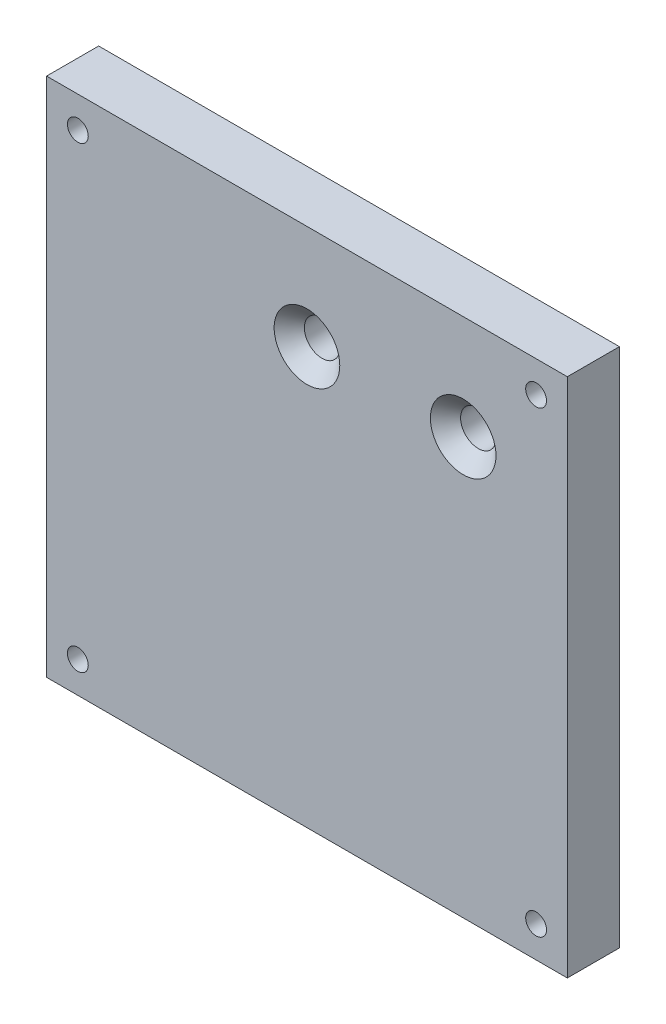
ISO-10303-21;
HEADER;
FILE_DESCRIPTION(('STEP AP214'),'2;1');
FILE_NAME('part.step','',(''),(''),'','','');
FILE_SCHEMA(('AUTOMOTIVE_DESIGN { 1 0 10303 214 1 1 1 1 }'));
ENDSEC;
DATA;
#1=APPLICATION_CONTEXT('core data for automotive mechanical design processes');
#2=APPLICATION_PROTOCOL_DEFINITION('international standard','automotive_design',2000,#1);
#3=PRODUCT_CONTEXT('',#1,'mechanical');
#4=PRODUCT('Part','Part','',(#3));
#5=PRODUCT_RELATED_PRODUCT_CATEGORY('part','',(#4));
#6=PRODUCT_DEFINITION_FORMATION('','',#4);
#7=PRODUCT_DEFINITION_CONTEXT('part definition',#1,'design');
#8=PRODUCT_DEFINITION('design','',#6,#7);
#9=PRODUCT_DEFINITION_SHAPE('','',#8);
#10=(LENGTH_UNIT() NAMED_UNIT(*) SI_UNIT(.MILLI.,.METRE.));
#11=(NAMED_UNIT(*) PLANE_ANGLE_UNIT() SI_UNIT($,.RADIAN.));
#12=(NAMED_UNIT(*) SI_UNIT($,.STERADIAN.) SOLID_ANGLE_UNIT());
#13=UNCERTAINTY_MEASURE_WITH_UNIT(LENGTH_MEASURE(1.E-05),#10,'distance_accuracy_value','');
#14=(GEOMETRIC_REPRESENTATION_CONTEXT(3) GLOBAL_UNCERTAINTY_ASSIGNED_CONTEXT((#13)) GLOBAL_UNIT_ASSIGNED_CONTEXT((#10,
#11,#12)) REPRESENTATION_CONTEXT('',''));
#15=CARTESIAN_POINT('',(0.,0.,0.));
#16=DIRECTION('',(0.,0.,1.));
#17=DIRECTION('',(1.,0.,0.));
#18=AXIS2_PLACEMENT_3D('',#15,#16,#17);
#19=CARTESIAN_POINT('',(0.,0.,5.));
#20=DIRECTION('',(0.,0.,1.));
#21=DIRECTION('',(1.,0.,0.));
#22=AXIS2_PLACEMENT_3D('',#19,#20,#21);
#23=PLANE('',#22);
#24=CARTESIAN_POINT('',(-13.4431055456172,38.082518783542,5.));
#25=DIRECTION('',(0.,0.,1.));
#26=DIRECTION('',(1.,0.,0.));
#27=AXIS2_PLACEMENT_3D('',#24,#25,#26);
#28=CIRCLE('',#27,3.15);
#29=CARTESIAN_POINT('',(-10.2931055456172,38.082518783542,5.));
#30=VERTEX_POINT('',#29);
#31=EDGE_CURVE('E150',#30,#30,#28,.T.);
#32=ORIENTED_EDGE('',*,*,#31,.F.);
#33=EDGE_LOOP('',(#32));
#34=FACE_BOUND('',#33,.T.);
#35=CARTESIAN_POINT('',(1.55689445438278,38.082518783542,5.));
#36=DIRECTION('',(0.,0.,1.));
#37=DIRECTION('',(1.,0.,0.));
#38=AXIS2_PLACEMENT_3D('',#35,#36,#37);
#39=CIRCLE('',#38,3.15);
#40=CARTESIAN_POINT('',(4.70689445438278,38.082518783542,5.));
#41=VERTEX_POINT('',#40);
#42=EDGE_CURVE('E141',#41,#41,#39,.T.);
#43=ORIENTED_EDGE('',*,*,#42,.F.);
#44=EDGE_LOOP('',(#43));
#45=FACE_BOUND('',#44,.T.);
#46=CARTESIAN_POINT('',(8.55689445438323,1.08251878354203,5.));
#47=DIRECTION('',(0.,0.,1.));
#48=DIRECTION('',(1.,0.,0.));
#49=AXIS2_PLACEMENT_3D('',#46,#47,#48);
#50=CIRCLE('',#49,1.);
#51=CARTESIAN_POINT('',(9.55689445438323,1.08251878354203,5.));
#52=VERTEX_POINT('',#51);
#53=EDGE_CURVE('E121',#52,#52,#50,.T.);
#54=ORIENTED_EDGE('',*,*,#53,.F.);
#55=EDGE_LOOP('',(#54));
#56=FACE_BOUND('',#55,.T.);
#57=CARTESIAN_POINT('',(-35.4431055456172,45.082518783542,5.));
#58=DIRECTION('',(0.,0.,1.));
#59=DIRECTION('',(1.,0.,0.));
#60=AXIS2_PLACEMENT_3D('',#57,#58,#59);
#61=CIRCLE('',#60,0.999999999999998);
#62=CARTESIAN_POINT('',(-34.4431055456172,45.082518783542,5.));
#63=VERTEX_POINT('',#62);
#64=EDGE_CURVE('E100',#63,#63,#61,.T.);
#65=ORIENTED_EDGE('',*,*,#64,.F.);
#66=EDGE_LOOP('',(#65));
#67=FACE_BOUND('',#66,.T.);
#68=DIRECTION('',(0.,-1.,0.));
#69=VECTOR('',#68,1.);
#70=CARTESIAN_POINT('',(-38.4431055456172,48.082518783542,5.));
#71=LINE('',#70,#69);
#72=CARTESIAN_POINT('',(-38.4431055456172,48.082518783542,5.));
#73=VERTEX_POINT('',#72);
#74=CARTESIAN_POINT('',(-38.4431055456172,-1.91748121645797,5.));
#75=VERTEX_POINT('',#74);
#76=EDGE_CURVE('E85',#73,#75,#71,.T.);
#77=ORIENTED_EDGE('',*,*,#76,.T.);
#78=DIRECTION('',(1.,0.,0.));
#79=VECTOR('',#78,1.);
#80=CARTESIAN_POINT('',(-38.4431055456172,-1.91748121645797,5.));
#81=LINE('',#80,#79);
#82=CARTESIAN_POINT('',(11.5568944543828,-1.91748121645797,5.));
#83=VERTEX_POINT('',#82);
#84=EDGE_CURVE('E80',#75,#83,#81,.T.);
#85=ORIENTED_EDGE('',*,*,#84,.T.);
#86=DIRECTION('',(0.,1.,0.));
#87=VECTOR('',#86,1.);
#88=CARTESIAN_POINT('',(11.5568944543828,48.082518783542,5.));
#89=LINE('',#88,#87);
#90=CARTESIAN_POINT('',(11.5568944543828,48.082518783542,5.));
#91=VERTEX_POINT('',#90);
#92=EDGE_CURVE('E83',#83,#91,#89,.T.);
#93=ORIENTED_EDGE('',*,*,#92,.T.);
#94=DIRECTION('',(-1.,0.,0.));
#95=VECTOR('',#94,1.);
#96=CARTESIAN_POINT('',(-38.4431055456172,48.082518783542,5.));
#97=LINE('',#96,#95);
#98=EDGE_CURVE('E50',#91,#73,#97,.T.);
#99=ORIENTED_EDGE('',*,*,#98,.T.);
#100=EDGE_LOOP('',(#77,#85,#93,#99));
#101=FACE_BOUND('',#100,.T.);
#102=CARTESIAN_POINT('',(8.55689445438277,45.082518783542,5.));
#103=DIRECTION('',(0.,0.,1.));
#104=DIRECTION('',(1.,0.,0.));
#105=AXIS2_PLACEMENT_3D('',#102,#103,#104);
#106=CIRCLE('',#105,1.);
#107=CARTESIAN_POINT('',(9.55689445438277,45.082518783542,5.));
#108=VERTEX_POINT('',#107);
#109=EDGE_CURVE('E115',#108,#108,#106,.T.);
#110=ORIENTED_EDGE('',*,*,#109,.F.);
#111=EDGE_LOOP('',(#110));
#112=FACE_BOUND('',#111,.T.);
#113=CARTESIAN_POINT('',(-35.4431055456168,1.08251878354203,5.));
#114=DIRECTION('',(0.,0.,1.));
#115=DIRECTION('',(1.,0.,0.));
#116=AXIS2_PLACEMENT_3D('',#113,#114,#115);
#117=CIRCLE('',#116,0.999999999999998);
#118=CARTESIAN_POINT('',(-34.4431055456168,1.08251878354203,5.));
#119=VERTEX_POINT('',#118);
#120=EDGE_CURVE('E127',#119,#119,#117,.T.);
#121=ORIENTED_EDGE('',*,*,#120,.F.);
#122=EDGE_LOOP('',(#121));
#123=FACE_BOUND('',#122,.T.);
#124=ADVANCED_FACE('F33',(#34,#45,#56,#67,#101,#112,#123),#23,.T.);
#125=CARTESIAN_POINT('',(0.,0.,0.));
#126=DIRECTION('',(0.,0.,1.));
#127=DIRECTION('',(1.,0.,0.));
#128=AXIS2_PLACEMENT_3D('',#125,#126,#127);
#129=PLANE('',#128);
#130=CARTESIAN_POINT('',(-13.4431055456172,38.082518783542,0.));
#131=DIRECTION('',(0.,0.,1.));
#132=DIRECTION('',(1.,0.,0.));
#133=AXIS2_PLACEMENT_3D('',#130,#131,#132);
#134=CIRCLE('',#133,1.7);
#135=CARTESIAN_POINT('',(-11.7431055456172,38.082518783542,0.));
#136=VERTEX_POINT('',#135);
#137=EDGE_CURVE('E144',#136,#136,#134,.T.);
#138=ORIENTED_EDGE('',*,*,#137,.T.);
#139=EDGE_LOOP('',(#138));
#140=FACE_BOUND('',#139,.T.);
#141=CARTESIAN_POINT('',(1.55689445438278,38.082518783542,0.));
#142=DIRECTION('',(0.,0.,1.));
#143=DIRECTION('',(1.,0.,0.));
#144=AXIS2_PLACEMENT_3D('',#141,#142,#143);
#145=CIRCLE('',#144,1.7);
#146=CARTESIAN_POINT('',(3.25689445438277,38.082518783542,0.));
#147=VERTEX_POINT('',#146);
#148=EDGE_CURVE('E133',#147,#147,#145,.T.);
#149=ORIENTED_EDGE('',*,*,#148,.T.);
#150=EDGE_LOOP('',(#149));
#151=FACE_BOUND('',#150,.T.);
#152=DIRECTION('',(0.,-1.,0.));
#153=VECTOR('',#152,1.);
#154=CARTESIAN_POINT('',(-38.4431055456172,48.082518783542,0.));
#155=LINE('',#154,#153);
#156=CARTESIAN_POINT('',(-38.4431055456172,48.082518783542,0.));
#157=VERTEX_POINT('',#156);
#158=CARTESIAN_POINT('',(-38.4431055456172,-1.91748121645797,0.));
#159=VERTEX_POINT('',#158);
#160=EDGE_CURVE('E97',#157,#159,#155,.T.);
#161=ORIENTED_EDGE('',*,*,#160,.F.);
#162=DIRECTION('',(-1.,0.,0.));
#163=VECTOR('',#162,1.);
#164=CARTESIAN_POINT('',(-38.4431055456172,48.082518783542,0.));
#165=LINE('',#164,#163);
#166=CARTESIAN_POINT('',(11.5568944543828,48.082518783542,0.));
#167=VERTEX_POINT('',#166);
#168=EDGE_CURVE('E73',#167,#157,#165,.T.);
#169=ORIENTED_EDGE('',*,*,#168,.F.);
#170=DIRECTION('',(0.,1.,0.));
#171=VECTOR('',#170,1.);
#172=CARTESIAN_POINT('',(11.5568944543828,48.082518783542,0.));
#173=LINE('',#172,#171);
#174=CARTESIAN_POINT('',(11.5568944543828,-1.91748121645797,0.));
#175=VERTEX_POINT('',#174);
#176=EDGE_CURVE('E67',#175,#167,#173,.T.);
#177=ORIENTED_EDGE('',*,*,#176,.F.);
#178=DIRECTION('',(1.,0.,0.));
#179=VECTOR('',#178,1.);
#180=CARTESIAN_POINT('',(-38.4431055456172,-1.91748121645797,0.));
#181=LINE('',#180,#179);
#182=EDGE_CURVE('E89',#159,#175,#181,.T.);
#183=ORIENTED_EDGE('',*,*,#182,.F.);
#184=EDGE_LOOP('',(#161,#169,#177,#183));
#185=FACE_BOUND('',#184,.T.);
#186=CARTESIAN_POINT('',(-35.4431055456172,45.082518783542,0.));
#187=DIRECTION('',(0.,0.,1.));
#188=DIRECTION('',(1.,0.,0.));
#189=AXIS2_PLACEMENT_3D('',#186,#187,#188);
#190=CIRCLE('',#189,0.999999999999998);
#191=CARTESIAN_POINT('',(-34.4431055456172,45.082518783542,0.));
#192=VERTEX_POINT('',#191);
#193=EDGE_CURVE('E112',#192,#192,#190,.T.);
#194=ORIENTED_EDGE('',*,*,#193,.T.);
#195=EDGE_LOOP('',(#194));
#196=FACE_BOUND('',#195,.T.);
#197=CARTESIAN_POINT('',(8.55689445438277,45.082518783542,0.));
#198=DIRECTION('',(0.,0.,1.));
#199=DIRECTION('',(1.,0.,0.));
#200=AXIS2_PLACEMENT_3D('',#197,#198,#199);
#201=CIRCLE('',#200,1.);
#202=CARTESIAN_POINT('',(9.55689445438277,45.082518783542,0.));
#203=VERTEX_POINT('',#202);
#204=EDGE_CURVE('E118',#203,#203,#201,.T.);
#205=ORIENTED_EDGE('',*,*,#204,.T.);
#206=EDGE_LOOP('',(#205));
#207=FACE_BOUND('',#206,.T.);
#208=CARTESIAN_POINT('',(8.55689445438323,1.08251878354203,0.));
#209=DIRECTION('',(0.,0.,1.));
#210=DIRECTION('',(1.,0.,0.));
#211=AXIS2_PLACEMENT_3D('',#208,#209,#210);
#212=CIRCLE('',#211,1.);
#213=CARTESIAN_POINT('',(9.55689445438323,1.08251878354203,0.));
#214=VERTEX_POINT('',#213);
#215=EDGE_CURVE('E124',#214,#214,#212,.T.);
#216=ORIENTED_EDGE('',*,*,#215,.T.);
#217=EDGE_LOOP('',(#216));
#218=FACE_BOUND('',#217,.T.);
#219=CARTESIAN_POINT('',(-35.4431055456168,1.08251878354203,0.));
#220=DIRECTION('',(0.,0.,1.));
#221=DIRECTION('',(1.,0.,0.));
#222=AXIS2_PLACEMENT_3D('',#219,#220,#221);
#223=CIRCLE('',#222,0.999999999999998);
#224=CARTESIAN_POINT('',(-34.4431055456168,1.08251878354203,0.));
#225=VERTEX_POINT('',#224);
#226=EDGE_CURVE('E130',#225,#225,#223,.T.);
#227=ORIENTED_EDGE('',*,*,#226,.T.);
#228=EDGE_LOOP('',(#227));
#229=FACE_BOUND('',#228,.T.);
#230=ADVANCED_FACE('F108',(#140,#151,#185,#196,#207,#218,#229),#129,.F.);
#231=CARTESIAN_POINT('',(-38.4431055456172,48.082518783542,5.));
#232=DIRECTION('',(1.,0.,0.));
#233=DIRECTION('',(0.,1.,0.));
#234=AXIS2_PLACEMENT_3D('',#231,#232,#233);
#235=PLANE('',#234);
#236=ORIENTED_EDGE('',*,*,#160,.T.);
#237=DIRECTION('',(0.,0.,-1.));
#238=VECTOR('',#237,1.);
#239=CARTESIAN_POINT('',(-38.4431055456172,-1.91748121645797,5.));
#240=LINE('',#239,#238);
#241=EDGE_CURVE('E11',#75,#159,#240,.T.);
#242=ORIENTED_EDGE('',*,*,#241,.F.);
#243=ORIENTED_EDGE('',*,*,#76,.F.);
#244=DIRECTION('',(0.,0.,-1.));
#245=VECTOR('',#244,1.);
#246=CARTESIAN_POINT('',(-38.4431055456172,48.082518783542,5.));
#247=LINE('',#246,#245);
#248=EDGE_CURVE('E93',#73,#157,#247,.T.);
#249=ORIENTED_EDGE('',*,*,#248,.T.);
#250=EDGE_LOOP('',(#236,#242,#243,#249));
#251=FACE_BOUND('',#250,.T.);
#252=ADVANCED_FACE('F35',(#251),#235,.F.);
#253=CARTESIAN_POINT('',(-38.4431055456172,-1.91748121645797,5.));
#254=DIRECTION('',(0.,1.,0.));
#255=DIRECTION('',(-1.,0.,0.));
#256=AXIS2_PLACEMENT_3D('',#253,#254,#255);
#257=PLANE('',#256);
#258=ORIENTED_EDGE('',*,*,#182,.T.);
#259=DIRECTION('',(0.,0.,-1.));
#260=VECTOR('',#259,1.);
#261=CARTESIAN_POINT('',(11.5568944543828,-1.91748121645797,5.));
#262=LINE('',#261,#260);
#263=EDGE_CURVE('E42',#83,#175,#262,.T.);
#264=ORIENTED_EDGE('',*,*,#263,.F.);
#265=ORIENTED_EDGE('',*,*,#84,.F.);
#266=ORIENTED_EDGE('',*,*,#241,.T.);
#267=EDGE_LOOP('',(#258,#264,#265,#266));
#268=FACE_BOUND('',#267,.T.);
#269=ADVANCED_FACE('F88',(#268),#257,.F.);
#270=CARTESIAN_POINT('',(11.5568944543828,48.082518783542,5.));
#271=DIRECTION('',(-1.,0.,0.));
#272=DIRECTION('',(0.,-1.,0.));
#273=AXIS2_PLACEMENT_3D('',#270,#271,#272);
#274=PLANE('',#273);
#275=ORIENTED_EDGE('',*,*,#176,.T.);
#276=DIRECTION('',(0.,0.,-1.));
#277=VECTOR('',#276,1.);
#278=CARTESIAN_POINT('',(11.5568944543828,48.082518783542,5.));
#279=LINE('',#278,#277);
#280=EDGE_CURVE('E90',#91,#167,#279,.T.);
#281=ORIENTED_EDGE('',*,*,#280,.F.);
#282=ORIENTED_EDGE('',*,*,#92,.F.);
#283=ORIENTED_EDGE('',*,*,#263,.T.);
#284=EDGE_LOOP('',(#275,#281,#282,#283));
#285=FACE_BOUND('',#284,.T.);
#286=ADVANCED_FACE('F91',(#285),#274,.F.);
#287=CARTESIAN_POINT('',(-38.4431055456172,48.082518783542,5.));
#288=DIRECTION('',(0.,-1.,0.));
#289=DIRECTION('',(0.,0.,-1.));
#290=AXIS2_PLACEMENT_3D('',#287,#288,#289);
#291=PLANE('',#290);
#292=ORIENTED_EDGE('',*,*,#168,.T.);
#293=ORIENTED_EDGE('',*,*,#248,.F.);
#294=ORIENTED_EDGE('',*,*,#98,.F.);
#295=ORIENTED_EDGE('',*,*,#280,.T.);
#296=EDGE_LOOP('',(#292,#293,#294,#295));
#297=FACE_BOUND('',#296,.T.);
#298=ADVANCED_FACE('F105',(#297),#291,.F.);
#299=CARTESIAN_POINT('',(-35.4431055456172,45.082518783542,5.));
#300=DIRECTION('',(0.,0.,-1.));
#301=DIRECTION('',(-1.,0.,0.));
#302=AXIS2_PLACEMENT_3D('',#299,#300,#301);
#303=CYLINDRICAL_SURFACE('',#302,0.999999999999998);
#304=ORIENTED_EDGE('',*,*,#64,.T.);
#305=EDGE_LOOP('',(#304));
#306=FACE_BOUND('',#305,.T.);
#307=ORIENTED_EDGE('',*,*,#193,.F.);
#308=EDGE_LOOP('',(#307));
#309=FACE_BOUND('',#308,.T.);
#310=ADVANCED_FACE('F165',(#306,#309),#303,.F.);
#311=CARTESIAN_POINT('',(8.55689445438277,45.082518783542,5.));
#312=DIRECTION('',(0.,0.,-1.));
#313=DIRECTION('',(-1.,0.,0.));
#314=AXIS2_PLACEMENT_3D('',#311,#312,#313);
#315=CYLINDRICAL_SURFACE('',#314,1.);
#316=ORIENTED_EDGE('',*,*,#109,.T.);
#317=EDGE_LOOP('',(#316));
#318=FACE_BOUND('',#317,.T.);
#319=ORIENTED_EDGE('',*,*,#204,.F.);
#320=EDGE_LOOP('',(#319));
#321=FACE_BOUND('',#320,.T.);
#322=ADVANCED_FACE('F168',(#318,#321),#315,.F.);
#323=CARTESIAN_POINT('',(8.55689445438323,1.08251878354203,5.));
#324=DIRECTION('',(0.,0.,-1.));
#325=DIRECTION('',(-1.,0.,0.));
#326=AXIS2_PLACEMENT_3D('',#323,#324,#325);
#327=CYLINDRICAL_SURFACE('',#326,1.);
#328=ORIENTED_EDGE('',*,*,#53,.T.);
#329=EDGE_LOOP('',(#328));
#330=FACE_BOUND('',#329,.T.);
#331=ORIENTED_EDGE('',*,*,#215,.F.);
#332=EDGE_LOOP('',(#331));
#333=FACE_BOUND('',#332,.T.);
#334=ADVANCED_FACE('F184',(#330,#333),#327,.F.);
#335=CARTESIAN_POINT('',(-35.4431055456168,1.08251878354203,5.));
#336=DIRECTION('',(0.,0.,-1.));
#337=DIRECTION('',(-1.,0.,0.));
#338=AXIS2_PLACEMENT_3D('',#335,#336,#337);
#339=CYLINDRICAL_SURFACE('',#338,0.999999999999998);
#340=ORIENTED_EDGE('',*,*,#120,.T.);
#341=EDGE_LOOP('',(#340));
#342=FACE_BOUND('',#341,.T.);
#343=ORIENTED_EDGE('',*,*,#226,.F.);
#344=EDGE_LOOP('',(#343));
#345=FACE_BOUND('',#344,.T.);
#346=ADVANCED_FACE('F181',(#342,#345),#339,.F.);
#347=CARTESIAN_POINT('',(1.55689445438278,38.082518783542,5.));
#348=DIRECTION('',(0.,0.,1.));
#349=DIRECTION('',(1.,0.,0.));
#350=AXIS2_PLACEMENT_3D('',#347,#348,#349);
#351=CYLINDRICAL_SURFACE('',#350,1.7);
#352=ORIENTED_EDGE('',*,*,#148,.F.);
#353=EDGE_LOOP('',(#352));
#354=FACE_BOUND('',#353,.T.);
#355=CARTESIAN_POINT('',(1.55689445438278,38.082518783542,3.55));
#356=DIRECTION('',(0.,0.,1.));
#357=DIRECTION('',(1.,0.,0.));
#358=AXIS2_PLACEMENT_3D('',#355,#356,#357);
#359=CIRCLE('',#358,1.7);
#360=CARTESIAN_POINT('',(3.25689445438277,38.082518783542,3.55));
#361=VERTEX_POINT('',#360);
#362=EDGE_CURVE('E138',#361,#361,#359,.T.);
#363=ORIENTED_EDGE('',*,*,#362,.T.);
#364=EDGE_LOOP('',(#363));
#365=FACE_BOUND('',#364,.T.);
#366=ADVANCED_FACE('F183',(#354,#365),#351,.F.);
#367=CARTESIAN_POINT('',(1.55689445438278,38.082518783542,5.));
#368=DIRECTION('',(0.,0.,1.));
#369=DIRECTION('',(1.,0.,0.));
#370=AXIS2_PLACEMENT_3D('',#367,#368,#369);
#371=CONICAL_SURFACE('',#370,3.15,0.785398163397448);
#372=ORIENTED_EDGE('',*,*,#362,.F.);
#373=EDGE_LOOP('',(#372));
#374=FACE_BOUND('',#373,.T.);
#375=ORIENTED_EDGE('',*,*,#42,.T.);
#376=EDGE_LOOP('',(#375));
#377=FACE_BOUND('',#376,.T.);
#378=ADVANCED_FACE('F191',(#374,#377),#371,.F.);
#379=CARTESIAN_POINT('',(-13.4431055456172,38.082518783542,5.));
#380=DIRECTION('',(0.,0.,1.));
#381=DIRECTION('',(1.,0.,0.));
#382=AXIS2_PLACEMENT_3D('',#379,#380,#381);
#383=CYLINDRICAL_SURFACE('',#382,1.7);
#384=ORIENTED_EDGE('',*,*,#137,.F.);
#385=EDGE_LOOP('',(#384));
#386=FACE_BOUND('',#385,.T.);
#387=CARTESIAN_POINT('',(-13.4431055456172,38.082518783542,3.55));
#388=DIRECTION('',(0.,0.,1.));
#389=DIRECTION('',(1.,0.,0.));
#390=AXIS2_PLACEMENT_3D('',#387,#388,#389);
#391=CIRCLE('',#390,1.7);
#392=CARTESIAN_POINT('',(-11.7431055456172,38.082518783542,3.55));
#393=VERTEX_POINT('',#392);
#394=EDGE_CURVE('E147',#393,#393,#391,.T.);
#395=ORIENTED_EDGE('',*,*,#394,.T.);
#396=EDGE_LOOP('',(#395));
#397=FACE_BOUND('',#396,.T.);
#398=ADVANCED_FACE('F275',(#386,#397),#383,.F.);
#399=CARTESIAN_POINT('',(-13.4431055456172,38.082518783542,5.));
#400=DIRECTION('',(0.,0.,1.));
#401=DIRECTION('',(1.,0.,0.));
#402=AXIS2_PLACEMENT_3D('',#399,#400,#401);
#403=CONICAL_SURFACE('',#402,3.15,0.785398163397449);
#404=ORIENTED_EDGE('',*,*,#394,.F.);
#405=EDGE_LOOP('',(#404));
#406=FACE_BOUND('',#405,.T.);
#407=ORIENTED_EDGE('',*,*,#31,.T.);
#408=EDGE_LOOP('',(#407));
#409=FACE_BOUND('',#408,.T.);
#410=ADVANCED_FACE('F154',(#406,#409),#403,.F.);
#411=CLOSED_SHELL('',(#124,#230,#252,#269,#286,#298,#310,#322,#334,#346,#366,#378,#398,#410));
#412=MANIFOLD_SOLID_BREP('B2',#411);
#413=ADVANCED_BREP_SHAPE_REPRESENTATION('',(#18,#412),#14);
#414=SHAPE_DEFINITION_REPRESENTATION(#9,#413);
ENDSEC;
END-ISO-10303-21;
